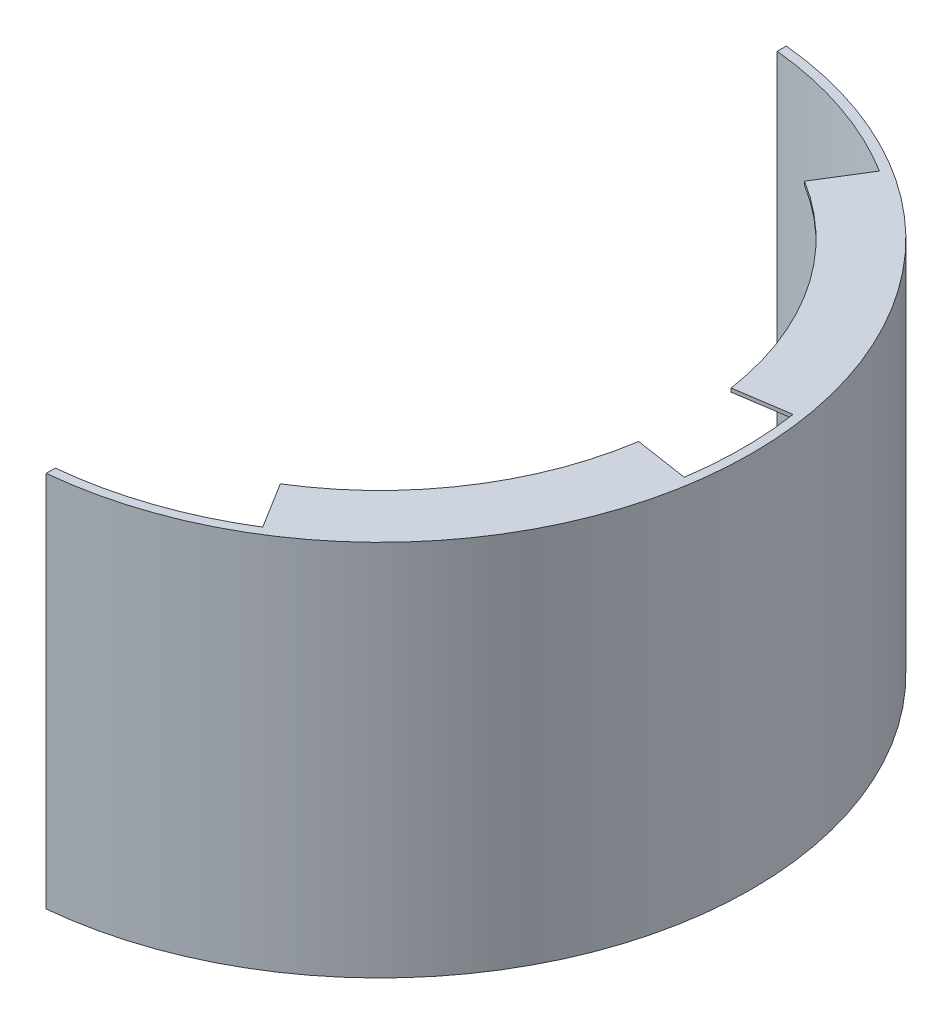
ISO-10303-21;
HEADER;
FILE_DESCRIPTION(('STEP AP214'),'2;1');
FILE_NAME('part.step','',(''),(''),'','','');
FILE_SCHEMA(('AUTOMOTIVE_DESIGN { 1 0 10303 214 1 1 1 1 }'));
ENDSEC;
DATA;
#1=APPLICATION_CONTEXT('core data for automotive mechanical design processes');
#2=APPLICATION_PROTOCOL_DEFINITION('international standard','automotive_design',2000,#1);
#3=PRODUCT_CONTEXT('',#1,'mechanical');
#4=PRODUCT('Part','Part','',(#3));
#5=PRODUCT_RELATED_PRODUCT_CATEGORY('part','',(#4));
#6=PRODUCT_DEFINITION_FORMATION('','',#4);
#7=PRODUCT_DEFINITION_CONTEXT('part definition',#1,'design');
#8=PRODUCT_DEFINITION('design','',#6,#7);
#9=PRODUCT_DEFINITION_SHAPE('','',#8);
#10=(LENGTH_UNIT() NAMED_UNIT(*) SI_UNIT(.MILLI.,.METRE.));
#11=(NAMED_UNIT(*) PLANE_ANGLE_UNIT() SI_UNIT($,.RADIAN.));
#12=(NAMED_UNIT(*) SI_UNIT($,.STERADIAN.) SOLID_ANGLE_UNIT());
#13=UNCERTAINTY_MEASURE_WITH_UNIT(LENGTH_MEASURE(1.E-05),#10,'distance_accuracy_value','');
#14=(GEOMETRIC_REPRESENTATION_CONTEXT(3) GLOBAL_UNCERTAINTY_ASSIGNED_CONTEXT((#13)) GLOBAL_UNIT_ASSIGNED_CONTEXT((#10,
#11,#12)) REPRESENTATION_CONTEXT('',''));
#15=CARTESIAN_POINT('',(0.,0.,0.));
#16=DIRECTION('',(0.,0.,1.));
#17=DIRECTION('',(1.,0.,0.));
#18=AXIS2_PLACEMENT_3D('',#15,#16,#17);
#19=CARTESIAN_POINT('',(0.,208.,0.));
#20=DIRECTION('',(0.,-1.,0.));
#21=DIRECTION('',(0.,0.,-1.));
#22=AXIS2_PLACEMENT_3D('',#19,#20,#21);
#23=CYLINDRICAL_SURFACE('',#22,200.);
#24=CARTESIAN_POINT('',(0.,208.,0.));
#25=DIRECTION('',(0.,-1.,0.));
#26=DIRECTION('',(0.,0.,1.));
#27=AXIS2_PLACEMENT_3D('',#24,#25,#26);
#28=CIRCLE('',#27,200.);
#29=CARTESIAN_POINT('',(197.737199332852,208.,-30.));
#30=VERTEX_POINT('',#29);
#31=CARTESIAN_POINT('',(197.737199332852,208.,30.));
#32=VERTEX_POINT('',#31);
#33=EDGE_CURVE('E203',#30,#32,#28,.T.);
#34=ORIENTED_EDGE('',*,*,#33,.F.);
#35=DIRECTION('',(0.,1.,0.));
#36=VECTOR('',#35,1.);
#37=CARTESIAN_POINT('',(197.737199332852,206.,-30.));
#38=LINE('',#37,#36);
#39=CARTESIAN_POINT('',(197.737199332852,206.,-30.));
#40=VERTEX_POINT('',#39);
#41=EDGE_CURVE('E197',#40,#30,#38,.T.);
#42=ORIENTED_EDGE('',*,*,#41,.F.);
#43=CARTESIAN_POINT('',(0.,206.,0.));
#44=DIRECTION('',(0.,1.,0.));
#45=DIRECTION('',(0.,0.,1.));
#46=AXIS2_PLACEMENT_3D('',#43,#44,#45);
#47=CIRCLE('',#46,200.);
#48=CARTESIAN_POINT('',(105.356537528527,206.,-170.));
#49=VERTEX_POINT('',#48);
#50=EDGE_CURVE('E182',#40,#49,#47,.T.);
#51=ORIENTED_EDGE('',*,*,#50,.T.);
#52=DIRECTION('',(0.,1.,0.));
#53=VECTOR('',#52,1.);
#54=CARTESIAN_POINT('',(105.356537528527,206.,-170.));
#55=LINE('',#54,#53);
#56=CARTESIAN_POINT('',(105.356537528527,208.,-170.));
#57=VERTEX_POINT('',#56);
#58=EDGE_CURVE('E516',#49,#57,#55,.T.);
#59=ORIENTED_EDGE('',*,*,#58,.T.);
#60=CARTESIAN_POINT('',(20.,208.,-198.997487421324));
#61=VERTEX_POINT('',#60);
#62=EDGE_CURVE('E301',#61,#57,#28,.T.);
#63=ORIENTED_EDGE('',*,*,#62,.F.);
#64=DIRECTION('',(0.,-1.,0.));
#65=VECTOR('',#64,1.);
#66=CARTESIAN_POINT('',(20.,208.,-198.997487421324));
#67=LINE('',#66,#65);
#68=CARTESIAN_POINT('',(20.,0.,-198.997487421324));
#69=VERTEX_POINT('',#68);
#70=EDGE_CURVE('E51',#61,#69,#67,.T.);
#71=ORIENTED_EDGE('',*,*,#70,.T.);
#72=CARTESIAN_POINT('',(0.,0.,0.));
#73=DIRECTION('',(0.,-1.,0.));
#74=DIRECTION('',(0.,0.,1.));
#75=AXIS2_PLACEMENT_3D('',#72,#73,#74);
#76=CIRCLE('',#75,200.);
#77=CARTESIAN_POINT('',(105.356537528527,0.,-170.));
#78=VERTEX_POINT('',#77);
#79=EDGE_CURVE('E312',#69,#78,#76,.T.);
#80=ORIENTED_EDGE('',*,*,#79,.T.);
#81=DIRECTION('',(0.,-1.,0.));
#82=VECTOR('',#81,1.);
#83=CARTESIAN_POINT('',(105.356537528527,2.,-170.));
#84=LINE('',#83,#82);
#85=CARTESIAN_POINT('',(105.356537528527,2.,-170.));
#86=VERTEX_POINT('',#85);
#87=EDGE_CURVE('E235',#86,#78,#84,.T.);
#88=ORIENTED_EDGE('',*,*,#87,.F.);
#89=CARTESIAN_POINT('',(0.,2.,0.));
#90=DIRECTION('',(0.,1.,0.));
#91=DIRECTION('',(0.,0.,1.));
#92=AXIS2_PLACEMENT_3D('',#89,#90,#91);
#93=CIRCLE('',#92,200.);
#94=CARTESIAN_POINT('',(197.737199332852,2.,-30.));
#95=VERTEX_POINT('',#94);
#96=EDGE_CURVE('E252',#95,#86,#93,.T.);
#97=ORIENTED_EDGE('',*,*,#96,.F.);
#98=DIRECTION('',(0.,-1.,0.));
#99=VECTOR('',#98,1.);
#100=CARTESIAN_POINT('',(197.737199332852,2.,-30.));
#101=LINE('',#100,#99);
#102=CARTESIAN_POINT('',(197.737199332852,0.,-30.));
#103=VERTEX_POINT('',#102);
#104=EDGE_CURVE('E244',#95,#103,#101,.T.);
#105=ORIENTED_EDGE('',*,*,#104,.T.);
#106=CARTESIAN_POINT('',(197.737199332852,0.,30.));
#107=VERTEX_POINT('',#106);
#108=EDGE_CURVE('E314',#103,#107,#76,.T.);
#109=ORIENTED_EDGE('',*,*,#108,.T.);
#110=DIRECTION('',(0.,-1.,0.));
#111=VECTOR('',#110,1.);
#112=CARTESIAN_POINT('',(197.737199332852,2.,30.));
#113=LINE('',#112,#111);
#114=CARTESIAN_POINT('',(197.737199332852,2.,30.));
#115=VERTEX_POINT('',#114);
#116=EDGE_CURVE('E290',#115,#107,#113,.T.);
#117=ORIENTED_EDGE('',*,*,#116,.F.);
#118=CARTESIAN_POINT('',(0.,2.,0.));
#119=DIRECTION('',(0.,1.,0.));
#120=DIRECTION('',(0.,0.,1.));
#121=AXIS2_PLACEMENT_3D('',#118,#119,#120);
#122=CIRCLE('',#121,200.);
#123=CARTESIAN_POINT('',(105.356537528527,2.,170.));
#124=VERTEX_POINT('',#123);
#125=EDGE_CURVE('E265',#124,#115,#122,.T.);
#126=ORIENTED_EDGE('',*,*,#125,.F.);
#127=DIRECTION('',(0.,-1.,0.));
#128=VECTOR('',#127,1.);
#129=CARTESIAN_POINT('',(105.356537528527,2.,170.));
#130=LINE('',#129,#128);
#131=CARTESIAN_POINT('',(105.356537528527,0.,170.));
#132=VERTEX_POINT('',#131);
#133=EDGE_CURVE('E276',#124,#132,#130,.T.);
#134=ORIENTED_EDGE('',*,*,#133,.T.);
#135=CARTESIAN_POINT('',(20.,0.,198.997487421324));
#136=VERTEX_POINT('',#135);
#137=EDGE_CURVE('E311',#132,#136,#76,.T.);
#138=ORIENTED_EDGE('',*,*,#137,.T.);
#139=DIRECTION('',(0.,-1.,0.));
#140=VECTOR('',#139,1.);
#141=CARTESIAN_POINT('',(20.,208.,198.997487421324));
#142=LINE('',#141,#140);
#143=CARTESIAN_POINT('',(20.,208.,198.997487421324));
#144=VERTEX_POINT('',#143);
#145=EDGE_CURVE('E318',#144,#136,#142,.T.);
#146=ORIENTED_EDGE('',*,*,#145,.F.);
#147=CARTESIAN_POINT('',(105.356537528527,208.,170.));
#148=VERTEX_POINT('',#147);
#149=EDGE_CURVE('E300',#148,#144,#28,.T.);
#150=ORIENTED_EDGE('',*,*,#149,.F.);
#151=DIRECTION('',(0.,1.,0.));
#152=VECTOR('',#151,1.);
#153=CARTESIAN_POINT('',(105.356537528527,206.,170.));
#154=LINE('',#153,#152);
#155=CARTESIAN_POINT('',(105.356537528527,206.,170.));
#156=VERTEX_POINT('',#155);
#157=EDGE_CURVE('E233',#156,#148,#154,.T.);
#158=ORIENTED_EDGE('',*,*,#157,.F.);
#159=CARTESIAN_POINT('',(0.,206.,0.));
#160=DIRECTION('',(0.,1.,0.));
#161=DIRECTION('',(0.,0.,1.));
#162=AXIS2_PLACEMENT_3D('',#159,#160,#161);
#163=CIRCLE('',#162,200.);
#164=CARTESIAN_POINT('',(197.737199332852,206.,30.));
#165=VERTEX_POINT('',#164);
#166=EDGE_CURVE('E211',#156,#165,#163,.T.);
#167=ORIENTED_EDGE('',*,*,#166,.T.);
#168=DIRECTION('',(0.,1.,0.));
#169=VECTOR('',#168,1.);
#170=CARTESIAN_POINT('',(197.737199332852,206.,30.));
#171=LINE('',#170,#169);
#172=EDGE_CURVE('E223',#165,#32,#171,.T.);
#173=ORIENTED_EDGE('',*,*,#172,.T.);
#174=EDGE_LOOP('',(#34,#42,#51,#59,#63,#71,#80,#88,#97,#105,#109,#117,#126,#134,#138,#146,#150,
#158,#167,#173));
#175=FACE_BOUND('',#174,.T.);
#176=ADVANCED_FACE('F43',(#175),#23,.F.);
#177=CARTESIAN_POINT('',(0.,208.,0.));
#178=DIRECTION('',(0.,-1.,0.));
#179=DIRECTION('',(0.,0.,-1.));
#180=AXIS2_PLACEMENT_3D('',#177,#178,#179);
#181=CYLINDRICAL_SURFACE('',#180,205.);
#182=CARTESIAN_POINT('',(0.,0.,0.));
#183=DIRECTION('',(0.,1.,0.));
#184=DIRECTION('',(0.,0.,1.));
#185=AXIS2_PLACEMENT_3D('',#182,#183,#184);
#186=CIRCLE('',#185,205.);
#187=CARTESIAN_POINT('',(20.,0.,204.022057631032));
#188=VERTEX_POINT('',#187);
#189=CARTESIAN_POINT('',(20.,0.,-204.022057631032));
#190=VERTEX_POINT('',#189);
#191=EDGE_CURVE('E293',#188,#190,#186,.T.);
#192=ORIENTED_EDGE('',*,*,#191,.T.);
#193=DIRECTION('',(0.,-1.,0.));
#194=VECTOR('',#193,1.);
#195=CARTESIAN_POINT('',(20.,208.,-204.022057631032));
#196=LINE('',#195,#194);
#197=CARTESIAN_POINT('',(20.,208.,-204.022057631032));
#198=VERTEX_POINT('',#197);
#199=EDGE_CURVE('E11',#198,#190,#196,.T.);
#200=ORIENTED_EDGE('',*,*,#199,.F.);
#201=CARTESIAN_POINT('',(0.,208.,0.));
#202=DIRECTION('',(0.,1.,0.));
#203=DIRECTION('',(0.,0.,1.));
#204=AXIS2_PLACEMENT_3D('',#201,#202,#203);
#205=CIRCLE('',#204,205.);
#206=CARTESIAN_POINT('',(20.,208.,204.022057631032));
#207=VERTEX_POINT('',#206);
#208=EDGE_CURVE('E294',#207,#198,#205,.T.);
#209=ORIENTED_EDGE('',*,*,#208,.F.);
#210=DIRECTION('',(0.,-1.,0.));
#211=VECTOR('',#210,1.);
#212=CARTESIAN_POINT('',(20.,208.,204.022057631032));
#213=LINE('',#212,#211);
#214=EDGE_CURVE('E306',#207,#188,#213,.T.);
#215=ORIENTED_EDGE('',*,*,#214,.T.);
#216=EDGE_LOOP('',(#192,#200,#209,#215));
#217=FACE_BOUND('',#216,.T.);
#218=ADVANCED_FACE('F45',(#217),#181,.T.);
#219=CARTESIAN_POINT('',(20.,208.,-204.022057631032));
#220=DIRECTION('',(1.,0.,0.));
#221=DIRECTION('',(0.,0.,-1.));
#222=AXIS2_PLACEMENT_3D('',#219,#220,#221);
#223=PLANE('',#222);
#224=DIRECTION('',(0.,0.,1.));
#225=VECTOR('',#224,1.);
#226=CARTESIAN_POINT('',(20.,0.,-204.022057631032));
#227=LINE('',#226,#225);
#228=EDGE_CURVE('E309',#190,#69,#227,.T.);
#229=ORIENTED_EDGE('',*,*,#228,.T.);
#230=ORIENTED_EDGE('',*,*,#70,.F.);
#231=DIRECTION('',(0.,0.,1.));
#232=VECTOR('',#231,1.);
#233=CARTESIAN_POINT('',(20.,208.,-204.022057631032));
#234=LINE('',#233,#232);
#235=EDGE_CURVE('E297',#198,#61,#234,.T.);
#236=ORIENTED_EDGE('',*,*,#235,.F.);
#237=ORIENTED_EDGE('',*,*,#199,.T.);
#238=EDGE_LOOP('',(#229,#230,#236,#237));
#239=FACE_BOUND('',#238,.T.);
#240=ADVANCED_FACE('F387',(#239),#223,.F.);
#241=CARTESIAN_POINT('',(20.,208.,198.997487421324));
#242=DIRECTION('',(1.,0.,0.));
#243=DIRECTION('',(0.,0.,-1.));
#244=AXIS2_PLACEMENT_3D('',#241,#242,#243);
#245=PLANE('',#244);
#246=DIRECTION('',(0.,0.,1.));
#247=VECTOR('',#246,1.);
#248=CARTESIAN_POINT('',(20.,0.,198.997487421324));
#249=LINE('',#248,#247);
#250=EDGE_CURVE('E298',#136,#188,#249,.T.);
#251=ORIENTED_EDGE('',*,*,#250,.T.);
#252=ORIENTED_EDGE('',*,*,#214,.F.);
#253=DIRECTION('',(0.,0.,1.));
#254=VECTOR('',#253,1.);
#255=CARTESIAN_POINT('',(20.,208.,198.997487421324));
#256=LINE('',#255,#254);
#257=EDGE_CURVE('E304',#144,#207,#256,.T.);
#258=ORIENTED_EDGE('',*,*,#257,.F.);
#259=ORIENTED_EDGE('',*,*,#145,.T.);
#260=EDGE_LOOP('',(#251,#252,#258,#259));
#261=FACE_BOUND('',#260,.T.);
#262=ADVANCED_FACE('F352',(#261),#245,.F.);
#263=CARTESIAN_POINT('',(0.,208.,0.));
#264=DIRECTION('',(0.,1.,0.));
#265=DIRECTION('',(0.,0.,1.));
#266=AXIS2_PLACEMENT_3D('',#263,#264,#265);
#267=PLANE('',#266);
#268=ORIENTED_EDGE('',*,*,#208,.T.);
#269=ORIENTED_EDGE('',*,*,#235,.T.);
#270=ORIENTED_EDGE('',*,*,#62,.T.);
#271=DIRECTION('',(-0.526782687642637,0.,0.85));
#272=VECTOR('',#271,1.);
#273=CARTESIAN_POINT('',(105.356537528527,208.,-170.));
#274=LINE('',#273,#272);
#275=CARTESIAN_POINT('',(89.5530568992483,208.,-144.5));
#276=VERTEX_POINT('',#275);
#277=EDGE_CURVE('E193',#57,#276,#274,.T.);
#278=ORIENTED_EDGE('',*,*,#277,.T.);
#279=CARTESIAN_POINT('',(0.,208.,0.));
#280=DIRECTION('',(0.,-1.,0.));
#281=DIRECTION('',(0.,0.,1.));
#282=AXIS2_PLACEMENT_3D('',#279,#280,#281);
#283=CIRCLE('',#282,170.);
#284=CARTESIAN_POINT('',(168.076619432924,208.,-25.5));
#285=VERTEX_POINT('',#284);
#286=EDGE_CURVE('E518',#276,#285,#283,.T.);
#287=ORIENTED_EDGE('',*,*,#286,.T.);
#288=DIRECTION('',(0.988685996664259,0.,-0.15));
#289=VECTOR('',#288,1.);
#290=CARTESIAN_POINT('',(197.737199332852,208.,-30.));
#291=LINE('',#290,#289);
#292=EDGE_CURVE('E58',#285,#30,#291,.T.);
#293=ORIENTED_EDGE('',*,*,#292,.T.);
#294=ORIENTED_EDGE('',*,*,#33,.T.);
#295=DIRECTION('',(-0.988685996664259,0.,-0.15));
#296=VECTOR('',#295,1.);
#297=CARTESIAN_POINT('',(197.737199332852,208.,30.));
#298=LINE('',#297,#296);
#299=CARTESIAN_POINT('',(168.076619432924,208.,25.5));
#300=VERTEX_POINT('',#299);
#301=EDGE_CURVE('E215',#32,#300,#298,.T.);
#302=ORIENTED_EDGE('',*,*,#301,.T.);
#303=CARTESIAN_POINT('',(0.,208.,0.));
#304=DIRECTION('',(0.,-1.,0.));
#305=DIRECTION('',(0.,0.,1.));
#306=AXIS2_PLACEMENT_3D('',#303,#304,#305);
#307=CIRCLE('',#306,170.);
#308=CARTESIAN_POINT('',(89.5530568992483,208.,144.5));
#309=VERTEX_POINT('',#308);
#310=EDGE_CURVE('E205',#300,#309,#307,.T.);
#311=ORIENTED_EDGE('',*,*,#310,.T.);
#312=DIRECTION('',(0.526782687642637,0.,0.85));
#313=VECTOR('',#312,1.);
#314=CARTESIAN_POINT('',(105.356537528527,208.,170.));
#315=LINE('',#314,#313);
#316=EDGE_CURVE('E65',#309,#148,#315,.T.);
#317=ORIENTED_EDGE('',*,*,#316,.T.);
#318=ORIENTED_EDGE('',*,*,#149,.T.);
#319=ORIENTED_EDGE('',*,*,#257,.T.);
#320=EDGE_LOOP('',(#268,#269,#270,#278,#287,#293,#294,#302,#311,#317,#318,#319));
#321=FACE_BOUND('',#320,.T.);
#322=ADVANCED_FACE('F357',(#321),#267,.T.);
#323=CARTESIAN_POINT('',(0.,0.,0.));
#324=DIRECTION('',(0.,1.,0.));
#325=DIRECTION('',(0.,0.,1.));
#326=AXIS2_PLACEMENT_3D('',#323,#324,#325);
#327=PLANE('',#326);
#328=ORIENTED_EDGE('',*,*,#191,.F.);
#329=ORIENTED_EDGE('',*,*,#250,.F.);
#330=ORIENTED_EDGE('',*,*,#137,.F.);
#331=DIRECTION('',(0.526782687642637,0.,0.85));
#332=VECTOR('',#331,1.);
#333=CARTESIAN_POINT('',(105.356537528527,0.,170.));
#334=LINE('',#333,#332);
#335=CARTESIAN_POINT('',(89.5530568992483,0.,144.5));
#336=VERTEX_POINT('',#335);
#337=EDGE_CURVE('E269',#336,#132,#334,.T.);
#338=ORIENTED_EDGE('',*,*,#337,.F.);
#339=CARTESIAN_POINT('',(0.,0.,0.));
#340=DIRECTION('',(0.,-1.,0.));
#341=DIRECTION('',(0.,0.,1.));
#342=AXIS2_PLACEMENT_3D('',#339,#340,#341);
#343=CIRCLE('',#342,170.);
#344=CARTESIAN_POINT('',(168.076619432924,0.,25.5));
#345=VERTEX_POINT('',#344);
#346=EDGE_CURVE('E278',#345,#336,#343,.T.);
#347=ORIENTED_EDGE('',*,*,#346,.F.);
#348=DIRECTION('',(-0.988685996664259,0.,-0.15));
#349=VECTOR('',#348,1.);
#350=CARTESIAN_POINT('',(197.737199332852,0.,30.));
#351=LINE('',#350,#349);
#352=EDGE_CURVE('E256',#107,#345,#351,.T.);
#353=ORIENTED_EDGE('',*,*,#352,.F.);
#354=ORIENTED_EDGE('',*,*,#108,.F.);
#355=DIRECTION('',(0.988685996664259,0.,-0.15));
#356=VECTOR('',#355,1.);
#357=CARTESIAN_POINT('',(197.737199332852,0.,-30.));
#358=LINE('',#357,#356);
#359=CARTESIAN_POINT('',(168.076619432924,0.,-25.5));
#360=VERTEX_POINT('',#359);
#361=EDGE_CURVE('E248',#360,#103,#358,.T.);
#362=ORIENTED_EDGE('',*,*,#361,.F.);
#363=CARTESIAN_POINT('',(0.,0.,0.));
#364=DIRECTION('',(0.,-1.,0.));
#365=DIRECTION('',(0.,0.,1.));
#366=AXIS2_PLACEMENT_3D('',#363,#364,#365);
#367=CIRCLE('',#366,170.);
#368=CARTESIAN_POINT('',(89.5530568992483,0.,-144.5));
#369=VERTEX_POINT('',#368);
#370=EDGE_CURVE('E251',#369,#360,#367,.T.);
#371=ORIENTED_EDGE('',*,*,#370,.F.);
#372=DIRECTION('',(-0.526782687642637,0.,0.85));
#373=VECTOR('',#372,1.);
#374=CARTESIAN_POINT('',(105.356537528527,0.,-170.));
#375=LINE('',#374,#373);
#376=EDGE_CURVE('E254',#78,#369,#375,.T.);
#377=ORIENTED_EDGE('',*,*,#376,.F.);
#378=ORIENTED_EDGE('',*,*,#79,.F.);
#379=ORIENTED_EDGE('',*,*,#228,.F.);
#380=EDGE_LOOP('',(#328,#329,#330,#338,#347,#353,#354,#362,#371,#377,#378,#379));
#381=FACE_BOUND('',#380,.T.);
#382=ADVANCED_FACE('F328',(#381),#327,.F.);
#383=CARTESIAN_POINT('',(197.737199332852,2.,30.));
#384=DIRECTION('',(-0.15,0.,0.988685996664259));
#385=DIRECTION('',(0.98868599666426,0.,0.15));
#386=AXIS2_PLACEMENT_3D('',#383,#384,#385);
#387=PLANE('',#386);
#388=ORIENTED_EDGE('',*,*,#352,.T.);
#389=DIRECTION('',(0.,-1.,0.));
#390=VECTOR('',#389,1.);
#391=CARTESIAN_POINT('',(168.076619432924,2.,25.5));
#392=LINE('',#391,#390);
#393=CARTESIAN_POINT('',(168.076619432924,2.,25.5));
#394=VERTEX_POINT('',#393);
#395=EDGE_CURVE('E287',#394,#345,#392,.T.);
#396=ORIENTED_EDGE('',*,*,#395,.F.);
#397=DIRECTION('',(-0.988685996664259,0.,-0.15));
#398=VECTOR('',#397,1.);
#399=CARTESIAN_POINT('',(197.737199332852,2.,30.));
#400=LINE('',#399,#398);
#401=EDGE_CURVE('E268',#115,#394,#400,.T.);
#402=ORIENTED_EDGE('',*,*,#401,.F.);
#403=ORIENTED_EDGE('',*,*,#116,.T.);
#404=EDGE_LOOP('',(#388,#396,#402,#403));
#405=FACE_BOUND('',#404,.T.);
#406=ADVANCED_FACE('F400',(#405),#387,.F.);
#407=CARTESIAN_POINT('',(0.,2.,0.));
#408=DIRECTION('',(0.,-1.,0.));
#409=DIRECTION('',(0.,0.,-1.));
#410=AXIS2_PLACEMENT_3D('',#407,#408,#409);
#411=CYLINDRICAL_SURFACE('',#410,170.);
#412=ORIENTED_EDGE('',*,*,#346,.T.);
#413=DIRECTION('',(0.,-1.,0.));
#414=VECTOR('',#413,1.);
#415=CARTESIAN_POINT('',(89.5530568992483,2.,144.5));
#416=LINE('',#415,#414);
#417=CARTESIAN_POINT('',(89.5530568992483,2.,144.5));
#418=VERTEX_POINT('',#417);
#419=EDGE_CURVE('E284',#418,#336,#416,.T.);
#420=ORIENTED_EDGE('',*,*,#419,.F.);
#421=CARTESIAN_POINT('',(0.,2.,0.));
#422=DIRECTION('',(0.,-1.,0.));
#423=DIRECTION('',(0.,0.,1.));
#424=AXIS2_PLACEMENT_3D('',#421,#422,#423);
#425=CIRCLE('',#424,170.);
#426=EDGE_CURVE('E271',#394,#418,#425,.T.);
#427=ORIENTED_EDGE('',*,*,#426,.F.);
#428=ORIENTED_EDGE('',*,*,#395,.T.);
#429=EDGE_LOOP('',(#412,#420,#427,#428));
#430=FACE_BOUND('',#429,.T.);
#431=ADVANCED_FACE('F404',(#430),#411,.F.);
#432=CARTESIAN_POINT('',(105.356537528527,2.,170.));
#433=DIRECTION('',(0.85,0.,-0.526782687642637));
#434=DIRECTION('',(-0.526782687642637,0.,-0.85));
#435=AXIS2_PLACEMENT_3D('',#432,#433,#434);
#436=PLANE('',#435);
#437=ORIENTED_EDGE('',*,*,#337,.T.);
#438=ORIENTED_EDGE('',*,*,#133,.F.);
#439=DIRECTION('',(0.526782687642637,0.,0.85));
#440=VECTOR('',#439,1.);
#441=CARTESIAN_POINT('',(105.356537528527,2.,170.));
#442=LINE('',#441,#440);
#443=EDGE_CURVE('E273',#418,#124,#442,.T.);
#444=ORIENTED_EDGE('',*,*,#443,.F.);
#445=ORIENTED_EDGE('',*,*,#419,.T.);
#446=EDGE_LOOP('',(#437,#438,#444,#445));
#447=FACE_BOUND('',#446,.T.);
#448=ADVANCED_FACE('F408',(#447),#436,.F.);
#449=CARTESIAN_POINT('',(0.,2.,0.));
#450=DIRECTION('',(0.,1.,0.));
#451=DIRECTION('',(0.,0.,1.));
#452=AXIS2_PLACEMENT_3D('',#449,#450,#451);
#453=PLANE('',#452);
#454=ORIENTED_EDGE('',*,*,#125,.T.);
#455=ORIENTED_EDGE('',*,*,#401,.T.);
#456=ORIENTED_EDGE('',*,*,#426,.T.);
#457=ORIENTED_EDGE('',*,*,#443,.T.);
#458=EDGE_LOOP('',(#454,#455,#456,#457));
#459=FACE_BOUND('',#458,.T.);
#460=ADVANCED_FACE('F412',(#459),#453,.T.);
#461=CARTESIAN_POINT('',(105.356537528527,2.,-170.));
#462=DIRECTION('',(0.85,0.,0.526782687642637));
#463=DIRECTION('',(0.526782687642637,0.,-0.85));
#464=AXIS2_PLACEMENT_3D('',#461,#462,#463);
#465=PLANE('',#464);
#466=ORIENTED_EDGE('',*,*,#376,.T.);
#467=DIRECTION('',(0.,-1.,0.));
#468=VECTOR('',#467,1.);
#469=CARTESIAN_POINT('',(89.5530568992483,2.,-144.5));
#470=LINE('',#469,#468);
#471=CARTESIAN_POINT('',(89.5530568992483,2.,-144.5));
#472=VERTEX_POINT('',#471);
#473=EDGE_CURVE('E238',#472,#369,#470,.T.);
#474=ORIENTED_EDGE('',*,*,#473,.F.);
#475=DIRECTION('',(-0.526782687642637,0.,0.85));
#476=VECTOR('',#475,1.);
#477=CARTESIAN_POINT('',(105.356537528527,2.,-170.));
#478=LINE('',#477,#476);
#479=EDGE_CURVE('E261',#86,#472,#478,.T.);
#480=ORIENTED_EDGE('',*,*,#479,.F.);
#481=ORIENTED_EDGE('',*,*,#87,.T.);
#482=EDGE_LOOP('',(#466,#474,#480,#481));
#483=FACE_BOUND('',#482,.T.);
#484=ADVANCED_FACE('F334',(#483),#465,.F.);
#485=CARTESIAN_POINT('',(0.,2.,0.));
#486=DIRECTION('',(0.,-1.,0.));
#487=DIRECTION('',(0.,0.,-1.));
#488=AXIS2_PLACEMENT_3D('',#485,#486,#487);
#489=CYLINDRICAL_SURFACE('',#488,170.);
#490=ORIENTED_EDGE('',*,*,#370,.T.);
#491=DIRECTION('',(0.,-1.,0.));
#492=VECTOR('',#491,1.);
#493=CARTESIAN_POINT('',(168.076619432924,2.,-25.5));
#494=LINE('',#493,#492);
#495=CARTESIAN_POINT('',(168.076619432924,2.,-25.5));
#496=VERTEX_POINT('',#495);
#497=EDGE_CURVE('E241',#496,#360,#494,.T.);
#498=ORIENTED_EDGE('',*,*,#497,.F.);
#499=CARTESIAN_POINT('',(0.,2.,0.));
#500=DIRECTION('',(0.,-1.,0.));
#501=DIRECTION('',(0.,0.,1.));
#502=AXIS2_PLACEMENT_3D('',#499,#500,#501);
#503=CIRCLE('',#502,170.);
#504=EDGE_CURVE('E259',#472,#496,#503,.T.);
#505=ORIENTED_EDGE('',*,*,#504,.F.);
#506=ORIENTED_EDGE('',*,*,#473,.T.);
#507=EDGE_LOOP('',(#490,#498,#505,#506));
#508=FACE_BOUND('',#507,.T.);
#509=ADVANCED_FACE('F420',(#508),#489,.F.);
#510=CARTESIAN_POINT('',(197.737199332852,2.,-30.));
#511=DIRECTION('',(-0.15,0.,-0.988685996664259));
#512=DIRECTION('',(-0.98868599666426,0.,0.15));
#513=AXIS2_PLACEMENT_3D('',#510,#511,#512);
#514=PLANE('',#513);
#515=ORIENTED_EDGE('',*,*,#361,.T.);
#516=ORIENTED_EDGE('',*,*,#104,.F.);
#517=DIRECTION('',(0.988685996664259,0.,-0.15));
#518=VECTOR('',#517,1.);
#519=CARTESIAN_POINT('',(197.737199332852,2.,-30.));
#520=LINE('',#519,#518);
#521=EDGE_CURVE('E247',#496,#95,#520,.T.);
#522=ORIENTED_EDGE('',*,*,#521,.F.);
#523=ORIENTED_EDGE('',*,*,#497,.T.);
#524=EDGE_LOOP('',(#515,#516,#522,#523));
#525=FACE_BOUND('',#524,.T.);
#526=ADVANCED_FACE('F342',(#525),#514,.F.);
#527=CARTESIAN_POINT('',(0.,2.,0.));
#528=DIRECTION('',(0.,1.,0.));
#529=DIRECTION('',(0.,0.,1.));
#530=AXIS2_PLACEMENT_3D('',#527,#528,#529);
#531=PLANE('',#530);
#532=ORIENTED_EDGE('',*,*,#96,.T.);
#533=ORIENTED_EDGE('',*,*,#479,.T.);
#534=ORIENTED_EDGE('',*,*,#504,.T.);
#535=ORIENTED_EDGE('',*,*,#521,.T.);
#536=EDGE_LOOP('',(#532,#533,#534,#535));
#537=FACE_BOUND('',#536,.T.);
#538=ADVANCED_FACE('F338',(#537),#531,.T.);
#539=CARTESIAN_POINT('',(105.356537528527,206.,170.));
#540=DIRECTION('',(-0.85,0.,0.526782687642637));
#541=DIRECTION('',(0.526782687642637,0.,0.85));
#542=AXIS2_PLACEMENT_3D('',#539,#540,#541);
#543=PLANE('',#542);
#544=ORIENTED_EDGE('',*,*,#316,.F.);
#545=DIRECTION('',(0.,1.,0.));
#546=VECTOR('',#545,1.);
#547=CARTESIAN_POINT('',(89.5530568992483,206.,144.5));
#548=LINE('',#547,#546);
#549=CARTESIAN_POINT('',(89.5530568992483,206.,144.5));
#550=VERTEX_POINT('',#549);
#551=EDGE_CURVE('E231',#550,#309,#548,.T.);
#552=ORIENTED_EDGE('',*,*,#551,.F.);
#553=DIRECTION('',(0.526782687642637,0.,0.85));
#554=VECTOR('',#553,1.);
#555=CARTESIAN_POINT('',(105.356537528527,206.,170.));
#556=LINE('',#555,#554);
#557=EDGE_CURVE('E214',#550,#156,#556,.T.);
#558=ORIENTED_EDGE('',*,*,#557,.T.);
#559=ORIENTED_EDGE('',*,*,#157,.T.);
#560=EDGE_LOOP('',(#544,#552,#558,#559));
#561=FACE_BOUND('',#560,.T.);
#562=ADVANCED_FACE('F369',(#561),#543,.T.);
#563=CARTESIAN_POINT('',(0.,206.,0.));
#564=DIRECTION('',(0.,1.,0.));
#565=DIRECTION('',(0.,0.,1.));
#566=AXIS2_PLACEMENT_3D('',#563,#564,#565);
#567=CYLINDRICAL_SURFACE('',#566,170.);
#568=ORIENTED_EDGE('',*,*,#310,.F.);
#569=DIRECTION('',(0.,1.,0.));
#570=VECTOR('',#569,1.);
#571=CARTESIAN_POINT('',(168.076619432924,206.,25.5));
#572=LINE('',#571,#570);
#573=CARTESIAN_POINT('',(168.076619432924,206.,25.5));
#574=VERTEX_POINT('',#573);
#575=EDGE_CURVE('E229',#574,#300,#572,.T.);
#576=ORIENTED_EDGE('',*,*,#575,.F.);
#577=CARTESIAN_POINT('',(0.,206.,0.));
#578=DIRECTION('',(0.,-1.,0.));
#579=DIRECTION('',(0.,0.,1.));
#580=AXIS2_PLACEMENT_3D('',#577,#578,#579);
#581=CIRCLE('',#580,170.);
#582=EDGE_CURVE('E218',#574,#550,#581,.T.);
#583=ORIENTED_EDGE('',*,*,#582,.T.);
#584=ORIENTED_EDGE('',*,*,#551,.T.);
#585=EDGE_LOOP('',(#568,#576,#583,#584));
#586=FACE_BOUND('',#585,.T.);
#587=ADVANCED_FACE('F371',(#586),#567,.F.);
#588=CARTESIAN_POINT('',(197.737199332852,206.,30.));
#589=DIRECTION('',(0.15,0.,-0.988685996664259));
#590=DIRECTION('',(-0.98868599666426,0.,-0.15));
#591=AXIS2_PLACEMENT_3D('',#588,#589,#590);
#592=PLANE('',#591);
#593=ORIENTED_EDGE('',*,*,#301,.F.);
#594=ORIENTED_EDGE('',*,*,#172,.F.);
#595=DIRECTION('',(-0.988685996664259,0.,-0.15));
#596=VECTOR('',#595,1.);
#597=CARTESIAN_POINT('',(197.737199332852,206.,30.));
#598=LINE('',#597,#596);
#599=EDGE_CURVE('E221',#165,#574,#598,.T.);
#600=ORIENTED_EDGE('',*,*,#599,.T.);
#601=ORIENTED_EDGE('',*,*,#575,.T.);
#602=EDGE_LOOP('',(#593,#594,#600,#601));
#603=FACE_BOUND('',#602,.T.);
#604=ADVANCED_FACE('F361',(#603),#592,.T.);
#605=CARTESIAN_POINT('',(0.,206.,0.));
#606=DIRECTION('',(0.,-1.,0.));
#607=DIRECTION('',(0.,0.,1.));
#608=AXIS2_PLACEMENT_3D('',#605,#606,#607);
#609=PLANE('',#608);
#610=ORIENTED_EDGE('',*,*,#166,.F.);
#611=ORIENTED_EDGE('',*,*,#557,.F.);
#612=ORIENTED_EDGE('',*,*,#582,.F.);
#613=ORIENTED_EDGE('',*,*,#599,.F.);
#614=EDGE_LOOP('',(#610,#611,#612,#613));
#615=FACE_BOUND('',#614,.T.);
#616=ADVANCED_FACE('F366',(#615),#609,.T.);
#617=CARTESIAN_POINT('',(197.737199332852,206.,-30.));
#618=DIRECTION('',(0.15,0.,0.988685996664259));
#619=DIRECTION('',(0.98868599666426,0.,-0.15));
#620=AXIS2_PLACEMENT_3D('',#617,#618,#619);
#621=PLANE('',#620);
#622=ORIENTED_EDGE('',*,*,#292,.F.);
#623=DIRECTION('',(0.,1.,0.));
#624=VECTOR('',#623,1.);
#625=CARTESIAN_POINT('',(168.076619432924,206.,-25.5));
#626=LINE('',#625,#624);
#627=CARTESIAN_POINT('',(168.076619432924,206.,-25.5));
#628=VERTEX_POINT('',#627);
#629=EDGE_CURVE('E199',#628,#285,#626,.T.);
#630=ORIENTED_EDGE('',*,*,#629,.F.);
#631=DIRECTION('',(0.988685996664259,0.,-0.15));
#632=VECTOR('',#631,1.);
#633=CARTESIAN_POINT('',(197.737199332852,206.,-30.));
#634=LINE('',#633,#632);
#635=EDGE_CURVE('E186',#628,#40,#634,.T.);
#636=ORIENTED_EDGE('',*,*,#635,.T.);
#637=ORIENTED_EDGE('',*,*,#41,.T.);
#638=EDGE_LOOP('',(#622,#630,#636,#637));
#639=FACE_BOUND('',#638,.T.);
#640=ADVANCED_FACE('F196',(#639),#621,.T.);
#641=CARTESIAN_POINT('',(0.,206.,0.));
#642=DIRECTION('',(0.,1.,0.));
#643=DIRECTION('',(0.,0.,1.));
#644=AXIS2_PLACEMENT_3D('',#641,#642,#643);
#645=CYLINDRICAL_SURFACE('',#644,170.);
#646=ORIENTED_EDGE('',*,*,#286,.F.);
#647=DIRECTION('',(0.,1.,0.));
#648=VECTOR('',#647,1.);
#649=CARTESIAN_POINT('',(89.5530568992483,206.,-144.5));
#650=LINE('',#649,#648);
#651=CARTESIAN_POINT('',(89.5530568992483,206.,-144.5));
#652=VERTEX_POINT('',#651);
#653=EDGE_CURVE('E207',#652,#276,#650,.T.);
#654=ORIENTED_EDGE('',*,*,#653,.F.);
#655=CARTESIAN_POINT('',(0.,206.,0.));
#656=DIRECTION('',(0.,-1.,0.));
#657=DIRECTION('',(0.,0.,1.));
#658=AXIS2_PLACEMENT_3D('',#655,#656,#657);
#659=CIRCLE('',#658,170.);
#660=EDGE_CURVE('E200',#652,#628,#659,.T.);
#661=ORIENTED_EDGE('',*,*,#660,.T.);
#662=ORIENTED_EDGE('',*,*,#629,.T.);
#663=EDGE_LOOP('',(#646,#654,#661,#662));
#664=FACE_BOUND('',#663,.T.);
#665=ADVANCED_FACE('F485',(#664),#645,.F.);
#666=CARTESIAN_POINT('',(105.356537528527,206.,-170.));
#667=DIRECTION('',(-0.85,0.,-0.526782687642637));
#668=DIRECTION('',(-0.526782687642637,0.,0.85));
#669=AXIS2_PLACEMENT_3D('',#666,#667,#668);
#670=PLANE('',#669);
#671=ORIENTED_EDGE('',*,*,#277,.F.);
#672=ORIENTED_EDGE('',*,*,#58,.F.);
#673=DIRECTION('',(-0.526782687642637,0.,0.85));
#674=VECTOR('',#673,1.);
#675=CARTESIAN_POINT('',(105.356537528527,206.,-170.));
#676=LINE('',#675,#674);
#677=EDGE_CURVE('E189',#49,#652,#676,.T.);
#678=ORIENTED_EDGE('',*,*,#677,.T.);
#679=ORIENTED_EDGE('',*,*,#653,.T.);
#680=EDGE_LOOP('',(#671,#672,#678,#679));
#681=FACE_BOUND('',#680,.T.);
#682=ADVANCED_FACE('F494',(#681),#670,.T.);
#683=CARTESIAN_POINT('',(0.,206.,0.));
#684=DIRECTION('',(0.,-1.,0.));
#685=DIRECTION('',(0.,0.,1.));
#686=AXIS2_PLACEMENT_3D('',#683,#684,#685);
#687=PLANE('',#686);
#688=ORIENTED_EDGE('',*,*,#50,.F.);
#689=ORIENTED_EDGE('',*,*,#635,.F.);
#690=ORIENTED_EDGE('',*,*,#660,.F.);
#691=ORIENTED_EDGE('',*,*,#677,.F.);
#692=EDGE_LOOP('',(#688,#689,#690,#691));
#693=FACE_BOUND('',#692,.T.);
#694=ADVANCED_FACE('F184',(#693),#687,.T.);
#695=CLOSED_SHELL('',(#176,#218,#240,#262,#322,#382,#406,#431,#448,#460,#484,#509,#526,#538,
#562,#587,#604,#616,#640,#665,#682,#694));
#696=MANIFOLD_SOLID_BREP('B2',#695);
#697=ADVANCED_BREP_SHAPE_REPRESENTATION('',(#18,#696),#14);
#698=SHAPE_DEFINITION_REPRESENTATION(#9,#697);
ENDSEC;
END-ISO-10303-21;
